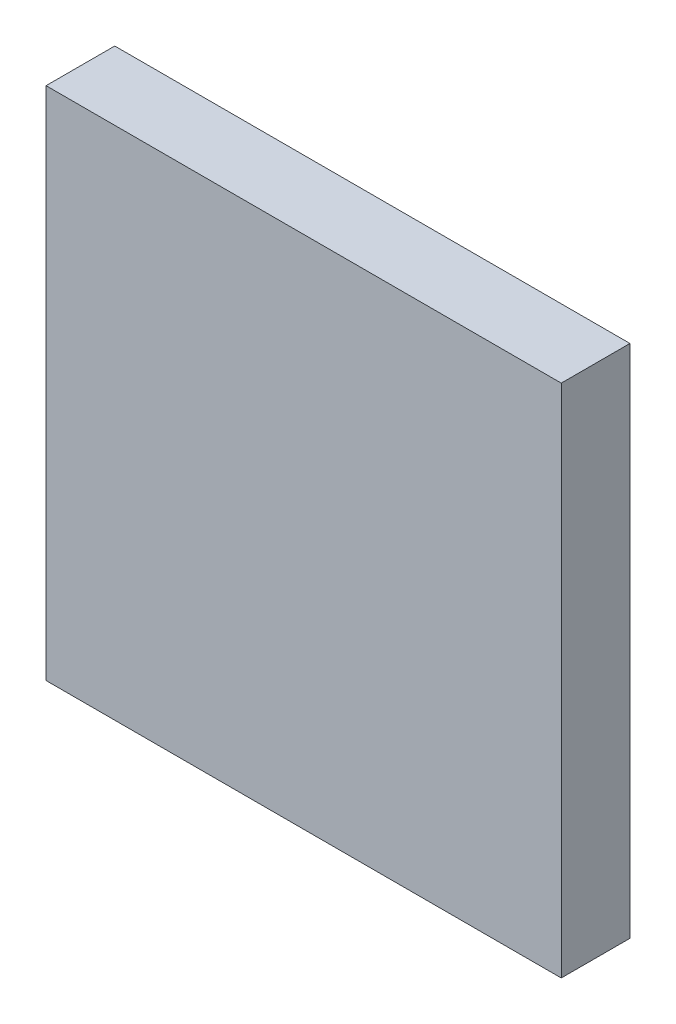
ISO-10303-21;
HEADER;
FILE_DESCRIPTION(('STEP AP214'),'2;1');
FILE_NAME('part.step','',(''),(''),'','','');
FILE_SCHEMA(('AUTOMOTIVE_DESIGN { 1 0 10303 214 1 1 1 1 }'));
ENDSEC;
DATA;
#1=APPLICATION_CONTEXT('core data for automotive mechanical design processes');
#2=APPLICATION_PROTOCOL_DEFINITION('international standard','automotive_design',2000,#1);
#3=PRODUCT_CONTEXT('',#1,'mechanical');
#4=PRODUCT('Part','Part','',(#3));
#5=PRODUCT_RELATED_PRODUCT_CATEGORY('part','',(#4));
#6=PRODUCT_DEFINITION_FORMATION('','',#4);
#7=PRODUCT_DEFINITION_CONTEXT('part definition',#1,'design');
#8=PRODUCT_DEFINITION('design','',#6,#7);
#9=PRODUCT_DEFINITION_SHAPE('','',#8);
#10=(LENGTH_UNIT() NAMED_UNIT(*) SI_UNIT(.MILLI.,.METRE.));
#11=(NAMED_UNIT(*) PLANE_ANGLE_UNIT() SI_UNIT($,.RADIAN.));
#12=(NAMED_UNIT(*) SI_UNIT($,.STERADIAN.) SOLID_ANGLE_UNIT());
#13=UNCERTAINTY_MEASURE_WITH_UNIT(LENGTH_MEASURE(1.E-05),#10,'distance_accuracy_value','');
#14=(GEOMETRIC_REPRESENTATION_CONTEXT(3) GLOBAL_UNCERTAINTY_ASSIGNED_CONTEXT((#13)) GLOBAL_UNIT_ASSIGNED_CONTEXT((#10,
#11,#12)) REPRESENTATION_CONTEXT('',''));
#15=CARTESIAN_POINT('',(0.,0.,0.));
#16=DIRECTION('',(0.,0.,1.));
#17=DIRECTION('',(1.,0.,0.));
#18=AXIS2_PLACEMENT_3D('',#15,#16,#17);
#19=CARTESIAN_POINT('',(23.0000003427267,7.00000010430813,1.5));
#20=DIRECTION('',(1.,0.,0.));
#21=DIRECTION('',(0.,1.,0.));
#22=AXIS2_PLACEMENT_3D('',#19,#20,#21);
#23=PLANE('',#22);
#24=DIRECTION('',(0.,-1.,0.));
#25=VECTOR('',#24,1.);
#26=CARTESIAN_POINT('',(23.0000003427267,13.0000001937151,1.5));
#27=LINE('',#26,#25);
#28=CARTESIAN_POINT('',(23.0000003427267,13.0000001937151,1.5));
#29=VERTEX_POINT('',#28);
#30=CARTESIAN_POINT('',(23.0000003427267,7.00000010430813,1.5));
#31=VERTEX_POINT('',#30);
#32=EDGE_CURVE('E38',#29,#31,#27,.T.);
#33=ORIENTED_EDGE('',*,*,#32,.F.);
#34=DIRECTION('',(0.,0.,1.));
#35=VECTOR('',#34,1.);
#36=CARTESIAN_POINT('',(23.0000003427267,13.0000001937151,1.5));
#37=LINE('',#36,#35);
#38=CARTESIAN_POINT('',(23.0000003427267,13.0000001937151,2.3));
#39=VERTEX_POINT('',#38);
#40=EDGE_CURVE('E11',#29,#39,#37,.T.);
#41=ORIENTED_EDGE('',*,*,#40,.T.);
#42=DIRECTION('',(0.,1.,0.));
#43=VECTOR('',#42,1.);
#44=CARTESIAN_POINT('',(23.0000003427267,13.0000001937151,2.3));
#45=LINE('',#44,#43);
#46=CARTESIAN_POINT('',(23.0000003427267,7.00000010430813,2.3));
#47=VERTEX_POINT('',#46);
#48=EDGE_CURVE('E50',#47,#39,#45,.T.);
#49=ORIENTED_EDGE('',*,*,#48,.F.);
#50=DIRECTION('',(0.,0.,1.));
#51=VECTOR('',#50,1.);
#52=CARTESIAN_POINT('',(23.0000003427267,7.00000010430813,1.5));
#53=LINE('',#52,#51);
#54=EDGE_CURVE('E26',#31,#47,#53,.T.);
#55=ORIENTED_EDGE('',*,*,#54,.F.);
#56=EDGE_LOOP('',(#33,#41,#49,#55));
#57=FACE_BOUND('',#56,.T.);
#58=ADVANCED_FACE('F16',(#57),#23,.T.);
#59=CARTESIAN_POINT('',(17.0000002533197,7.00000010430813,1.5));
#60=DIRECTION('',(0.,-1.,0.));
#61=DIRECTION('',(0.,0.,-1.));
#62=AXIS2_PLACEMENT_3D('',#59,#60,#61);
#63=PLANE('',#62);
#64=DIRECTION('',(-1.,0.,0.));
#65=VECTOR('',#64,1.);
#66=CARTESIAN_POINT('',(23.0000003427267,7.00000010430813,1.5));
#67=LINE('',#66,#65);
#68=CARTESIAN_POINT('',(17.0000002533197,7.00000010430813,1.5));
#69=VERTEX_POINT('',#68);
#70=EDGE_CURVE('E107',#31,#69,#67,.T.);
#71=ORIENTED_EDGE('',*,*,#70,.F.);
#72=ORIENTED_EDGE('',*,*,#54,.T.);
#73=DIRECTION('',(1.,0.,0.));
#74=VECTOR('',#73,1.);
#75=CARTESIAN_POINT('',(23.0000003427267,7.00000010430813,2.3));
#76=LINE('',#75,#74);
#77=CARTESIAN_POINT('',(17.0000002533197,7.00000010430813,2.3));
#78=VERTEX_POINT('',#77);
#79=EDGE_CURVE('E20',#78,#47,#76,.T.);
#80=ORIENTED_EDGE('',*,*,#79,.F.);
#81=DIRECTION('',(0.,0.,1.));
#82=VECTOR('',#81,1.);
#83=CARTESIAN_POINT('',(17.0000002533197,7.00000010430813,1.5));
#84=LINE('',#83,#82);
#85=EDGE_CURVE('E77',#69,#78,#84,.T.);
#86=ORIENTED_EDGE('',*,*,#85,.F.);
#87=EDGE_LOOP('',(#71,#72,#80,#86));
#88=FACE_BOUND('',#87,.T.);
#89=ADVANCED_FACE('F76',(#88),#63,.T.);
#90=CARTESIAN_POINT('',(17.0000002533197,13.0000001937151,1.5));
#91=DIRECTION('',(-1.,0.,0.));
#92=DIRECTION('',(0.,0.,1.));
#93=AXIS2_PLACEMENT_3D('',#90,#91,#92);
#94=PLANE('',#93);
#95=DIRECTION('',(0.,1.,0.));
#96=VECTOR('',#95,1.);
#97=CARTESIAN_POINT('',(17.0000002533197,7.00000010430813,1.5));
#98=LINE('',#97,#96);
#99=CARTESIAN_POINT('',(17.0000002533197,13.0000001937151,1.5));
#100=VERTEX_POINT('',#99);
#101=EDGE_CURVE('E86',#69,#100,#98,.T.);
#102=ORIENTED_EDGE('',*,*,#101,.F.);
#103=ORIENTED_EDGE('',*,*,#85,.T.);
#104=DIRECTION('',(0.,-1.,0.));
#105=VECTOR('',#104,1.);
#106=CARTESIAN_POINT('',(17.0000002533197,7.00000010430813,2.3));
#107=LINE('',#106,#105);
#108=CARTESIAN_POINT('',(17.0000002533197,13.0000001937151,2.3));
#109=VERTEX_POINT('',#108);
#110=EDGE_CURVE('E81',#109,#78,#107,.T.);
#111=ORIENTED_EDGE('',*,*,#110,.F.);
#112=DIRECTION('',(0.,0.,1.));
#113=VECTOR('',#112,1.);
#114=CARTESIAN_POINT('',(17.0000002533197,13.0000001937151,1.5));
#115=LINE('',#114,#113);
#116=EDGE_CURVE('E88',#100,#109,#115,.T.);
#117=ORIENTED_EDGE('',*,*,#116,.F.);
#118=EDGE_LOOP('',(#102,#103,#111,#117));
#119=FACE_BOUND('',#118,.T.);
#120=ADVANCED_FACE('F83',(#119),#94,.T.);
#121=CARTESIAN_POINT('',(23.0000003427267,13.0000001937151,1.5));
#122=DIRECTION('',(0.,1.,0.));
#123=DIRECTION('',(1.,0.,0.));
#124=AXIS2_PLACEMENT_3D('',#121,#122,#123);
#125=PLANE('',#124);
#126=DIRECTION('',(1.,0.,0.));
#127=VECTOR('',#126,1.);
#128=CARTESIAN_POINT('',(17.0000002533197,13.0000001937151,1.5));
#129=LINE('',#128,#127);
#130=EDGE_CURVE('E99',#100,#29,#129,.T.);
#131=ORIENTED_EDGE('',*,*,#130,.F.);
#132=ORIENTED_EDGE('',*,*,#116,.T.);
#133=DIRECTION('',(-1.,0.,0.));
#134=VECTOR('',#133,1.);
#135=CARTESIAN_POINT('',(17.0000002533197,13.0000001937151,2.3));
#136=LINE('',#135,#134);
#137=EDGE_CURVE('E91',#39,#109,#136,.T.);
#138=ORIENTED_EDGE('',*,*,#137,.F.);
#139=ORIENTED_EDGE('',*,*,#40,.F.);
#140=EDGE_LOOP('',(#131,#132,#138,#139));
#141=FACE_BOUND('',#140,.T.);
#142=ADVANCED_FACE('F121',(#141),#125,.T.);
#143=CARTESIAN_POINT('',(20.0000002980232,10.0000001490116,2.3));
#144=DIRECTION('',(0.,0.,1.));
#145=DIRECTION('',(1.,0.,0.));
#146=AXIS2_PLACEMENT_3D('',#143,#144,#145);
#147=PLANE('',#146);
#148=ORIENTED_EDGE('',*,*,#137,.T.);
#149=ORIENTED_EDGE('',*,*,#110,.T.);
#150=ORIENTED_EDGE('',*,*,#79,.T.);
#151=ORIENTED_EDGE('',*,*,#48,.T.);
#152=EDGE_LOOP('',(#148,#149,#150,#151));
#153=FACE_BOUND('',#152,.T.);
#154=ADVANCED_FACE('F18',(#153),#147,.T.);
#155=CARTESIAN_POINT('',(20.0000002980232,10.0000001490116,1.5));
#156=DIRECTION('',(0.,0.,1.));
#157=DIRECTION('',(1.,0.,0.));
#158=AXIS2_PLACEMENT_3D('',#155,#156,#157);
#159=PLANE('',#158);
#160=ORIENTED_EDGE('',*,*,#130,.T.);
#161=ORIENTED_EDGE('',*,*,#32,.T.);
#162=ORIENTED_EDGE('',*,*,#70,.T.);
#163=ORIENTED_EDGE('',*,*,#101,.T.);
#164=EDGE_LOOP('',(#160,#161,#162,#163));
#165=FACE_BOUND('',#164,.T.);
#166=ADVANCED_FACE('F118',(#165),#159,.F.);
#167=CLOSED_SHELL('',(#58,#89,#120,#142,#154,#166));
#168=MANIFOLD_SOLID_BREP('B1',#167);
#169=ADVANCED_BREP_SHAPE_REPRESENTATION('',(#18,#168),#14);
#170=SHAPE_DEFINITION_REPRESENTATION(#9,#169);
ENDSEC;
END-ISO-10303-21;
